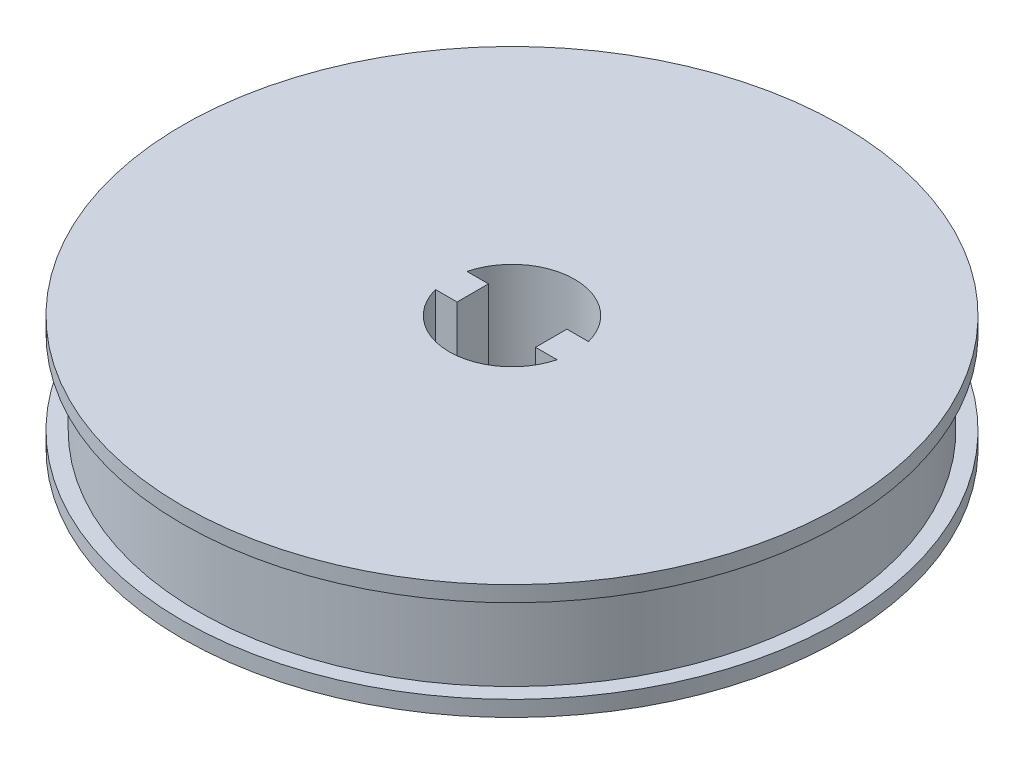
ISO-10303-21;
HEADER;
FILE_DESCRIPTION(('STEP AP214'),'2;1');
FILE_NAME('part.step','',(''),(''),'','','');
FILE_SCHEMA(('AUTOMOTIVE_DESIGN { 1 0 10303 214 1 1 1 1 }'));
ENDSEC;
DATA;
#1=APPLICATION_CONTEXT('core data for automotive mechanical design processes');
#2=APPLICATION_PROTOCOL_DEFINITION('international standard','automotive_design',2000,#1);
#3=PRODUCT_CONTEXT('',#1,'mechanical');
#4=PRODUCT('Part','Part','',(#3));
#5=PRODUCT_RELATED_PRODUCT_CATEGORY('part','',(#4));
#6=PRODUCT_DEFINITION_FORMATION('','',#4);
#7=PRODUCT_DEFINITION_CONTEXT('part definition',#1,'design');
#8=PRODUCT_DEFINITION('design','',#6,#7);
#9=PRODUCT_DEFINITION_SHAPE('','',#8);
#10=(LENGTH_UNIT() NAMED_UNIT(*) SI_UNIT(.MILLI.,.METRE.));
#11=(NAMED_UNIT(*) PLANE_ANGLE_UNIT() SI_UNIT($,.RADIAN.));
#12=(NAMED_UNIT(*) SI_UNIT($,.STERADIAN.) SOLID_ANGLE_UNIT());
#13=UNCERTAINTY_MEASURE_WITH_UNIT(LENGTH_MEASURE(1.E-05),#10,'distance_accuracy_value','');
#14=(GEOMETRIC_REPRESENTATION_CONTEXT(3) GLOBAL_UNCERTAINTY_ASSIGNED_CONTEXT((#13)) GLOBAL_UNIT_ASSIGNED_CONTEXT((#10,
#11,#12)) REPRESENTATION_CONTEXT('',''));
#15=CARTESIAN_POINT('',(0.,0.,0.));
#16=DIRECTION('',(0.,0.,1.));
#17=DIRECTION('',(1.,0.,0.));
#18=AXIS2_PLACEMENT_3D('',#15,#16,#17);
#19=CARTESIAN_POINT('',(0.,0.,0.));
#20=DIRECTION('',(0.,-1.,0.));
#21=DIRECTION('',(0.,0.,-1.));
#22=AXIS2_PLACEMENT_3D('',#19,#20,#21);
#23=CYLINDRICAL_SURFACE('',#22,6.);
#24=DIRECTION('',(0.,-1.,0.));
#25=VECTOR('',#24,1.);
#26=CARTESIAN_POINT('',(5.80947501931113,0.,1.5));
#27=LINE('',#26,#25);
#28=CARTESIAN_POINT('',(5.80947501931113,-5.63471383479231,1.5));
#29=VERTEX_POINT('',#28);
#30=CARTESIAN_POINT('',(5.80947501931113,5.3652861652077,1.5));
#31=VERTEX_POINT('',#30);
#32=EDGE_CURVE('E11',#29,#31,#27,.F.);
#33=ORIENTED_EDGE('',*,*,#32,.F.);
#34=CARTESIAN_POINT('',(0.,-5.6347138347923,0.));
#35=DIRECTION('',(0.,-1.,0.));
#36=DIRECTION('',(0.,0.,-1.));
#37=AXIS2_PLACEMENT_3D('',#34,#35,#36);
#38=CIRCLE('',#37,6.);
#39=CARTESIAN_POINT('',(-5.80947501931113,-5.63471383479231,1.5));
#40=VERTEX_POINT('',#39);
#41=EDGE_CURVE('E152',#29,#40,#38,.T.);
#42=ORIENTED_EDGE('',*,*,#41,.T.);
#43=DIRECTION('',(0.,-1.,0.));
#44=VECTOR('',#43,1.);
#45=CARTESIAN_POINT('',(-5.80947501931113,0.,1.5));
#46=LINE('',#45,#44);
#47=CARTESIAN_POINT('',(-5.80947501931113,5.36528616520769,1.5));
#48=VERTEX_POINT('',#47);
#49=EDGE_CURVE('E175',#48,#40,#46,.T.);
#50=ORIENTED_EDGE('',*,*,#49,.F.);
#51=CARTESIAN_POINT('',(0.,5.3652861652077,0.));
#52=DIRECTION('',(0.,-1.,0.));
#53=DIRECTION('',(0.,0.,-1.));
#54=AXIS2_PLACEMENT_3D('',#51,#52,#53);
#55=CIRCLE('',#54,6.);
#56=EDGE_CURVE('E148',#31,#48,#55,.T.);
#57=ORIENTED_EDGE('',*,*,#56,.F.);
#58=EDGE_LOOP('',(#33,#42,#50,#57));
#59=FACE_BOUND('',#58,.T.);
#60=ADVANCED_FACE('F35',(#59),#23,.F.);
#61=CARTESIAN_POINT('',(6.,5.36528616520769,0.));
#62=DIRECTION('',(0.,1.,0.));
#63=DIRECTION('',(0.,0.,1.));
#64=AXIS2_PLACEMENT_3D('',#61,#62,#63);
#65=PLANE('',#64);
#66=CARTESIAN_POINT('',(-5.80947501931112,5.3652861652077,-1.5));
#67=VERTEX_POINT('',#66);
#68=CARTESIAN_POINT('',(5.80947501931113,5.36528616520769,-1.5));
#69=VERTEX_POINT('',#68);
#70=EDGE_CURVE('E150',#67,#69,#55,.T.);
#71=ORIENTED_EDGE('',*,*,#70,.T.);
#72=DIRECTION('',(-1.,0.,0.));
#73=VECTOR('',#72,1.);
#74=CARTESIAN_POINT('',(8.25,5.36528616520769,-1.5));
#75=LINE('',#74,#73);
#76=CARTESIAN_POINT('',(3.75,5.36528616520769,-1.5));
#77=VERTEX_POINT('',#76);
#78=EDGE_CURVE('E128',#69,#77,#75,.T.);
#79=ORIENTED_EDGE('',*,*,#78,.T.);
#80=DIRECTION('',(0.,0.,1.));
#81=VECTOR('',#80,1.);
#82=CARTESIAN_POINT('',(3.75,5.36528616520769,1.5));
#83=LINE('',#82,#81);
#84=CARTESIAN_POINT('',(3.75,5.36528616520769,1.5));
#85=VERTEX_POINT('',#84);
#86=EDGE_CURVE('E117',#77,#85,#83,.T.);
#87=ORIENTED_EDGE('',*,*,#86,.T.);
#88=DIRECTION('',(1.,0.,0.));
#89=VECTOR('',#88,1.);
#90=CARTESIAN_POINT('',(8.25,5.36528616520769,1.5));
#91=LINE('',#90,#89);
#92=EDGE_CURVE('E50',#85,#31,#91,.T.);
#93=ORIENTED_EDGE('',*,*,#92,.T.);
#94=ORIENTED_EDGE('',*,*,#56,.T.);
#95=DIRECTION('',(1.,0.,0.));
#96=VECTOR('',#95,1.);
#97=CARTESIAN_POINT('',(-8.25,5.36528616520769,1.5));
#98=LINE('',#97,#96);
#99=CARTESIAN_POINT('',(-3.75,5.36528616520769,1.5));
#100=VERTEX_POINT('',#99);
#101=EDGE_CURVE('E137',#48,#100,#98,.T.);
#102=ORIENTED_EDGE('',*,*,#101,.T.);
#103=DIRECTION('',(0.,0.,-1.));
#104=VECTOR('',#103,1.);
#105=CARTESIAN_POINT('',(-3.75,5.36528616520769,1.5));
#106=LINE('',#105,#104);
#107=CARTESIAN_POINT('',(-3.75,5.36528616520769,-1.5));
#108=VERTEX_POINT('',#107);
#109=EDGE_CURVE('E131',#100,#108,#106,.T.);
#110=ORIENTED_EDGE('',*,*,#109,.T.);
#111=DIRECTION('',(-1.,0.,0.));
#112=VECTOR('',#111,1.);
#113=CARTESIAN_POINT('',(-8.25,5.36528616520769,-1.5));
#114=LINE('',#113,#112);
#115=EDGE_CURVE('E56',#108,#67,#114,.T.);
#116=ORIENTED_EDGE('',*,*,#115,.T.);
#117=EDGE_LOOP('',(#71,#79,#87,#93,#94,#102,#110,#116));
#118=FACE_BOUND('',#117,.T.);
#119=CARTESIAN_POINT('',(0.,5.36528616520768,0.));
#120=DIRECTION('',(0.,-1.,0.));
#121=DIRECTION('',(0.,0.,-1.));
#122=AXIS2_PLACEMENT_3D('',#119,#120,#121);
#123=CIRCLE('',#122,31.5);
#124=CARTESIAN_POINT('',(0.,5.36528616520768,-31.5));
#125=VERTEX_POINT('',#124);
#126=EDGE_CURVE('E170',#125,#125,#123,.T.);
#127=ORIENTED_EDGE('',*,*,#126,.F.);
#128=EDGE_LOOP('',(#127));
#129=FACE_BOUND('',#128,.T.);
#130=ADVANCED_FACE('F37',(#118,#129),#65,.T.);
#131=CARTESIAN_POINT('',(0.,0.,0.));
#132=DIRECTION('',(0.,-1.,0.));
#133=DIRECTION('',(0.,0.,-1.));
#134=AXIS2_PLACEMENT_3D('',#131,#132,#133);
#135=CYLINDRICAL_SURFACE('',#134,31.5);
#136=ORIENTED_EDGE('',*,*,#126,.T.);
#137=EDGE_LOOP('',(#136));
#138=FACE_BOUND('',#137,.T.);
#139=CARTESIAN_POINT('',(0.,3.86528616520768,0.));
#140=DIRECTION('',(0.,-1.,0.));
#141=DIRECTION('',(0.,0.,-1.));
#142=AXIS2_PLACEMENT_3D('',#139,#140,#141);
#143=CIRCLE('',#142,31.5);
#144=CARTESIAN_POINT('',(0.,3.86528616520768,-31.5));
#145=VERTEX_POINT('',#144);
#146=EDGE_CURVE('E167',#145,#145,#143,.T.);
#147=ORIENTED_EDGE('',*,*,#146,.F.);
#148=EDGE_LOOP('',(#147));
#149=FACE_BOUND('',#148,.T.);
#150=ADVANCED_FACE('F214',(#138,#149),#135,.T.);
#151=CARTESIAN_POINT('',(31.5,3.86528616520769,0.));
#152=DIRECTION('',(0.,-1.,0.));
#153=DIRECTION('',(0.,0.,-1.));
#154=AXIS2_PLACEMENT_3D('',#151,#152,#153);
#155=PLANE('',#154);
#156=ORIENTED_EDGE('',*,*,#146,.T.);
#157=EDGE_LOOP('',(#156));
#158=FACE_BOUND('',#157,.T.);
#159=CARTESIAN_POINT('',(0.,3.8652861652077,0.));
#160=DIRECTION('',(0.,-1.,0.));
#161=DIRECTION('',(0.,0.,-1.));
#162=AXIS2_PLACEMENT_3D('',#159,#160,#161);
#163=CIRCLE('',#162,30.);
#164=CARTESIAN_POINT('',(0.,3.8652861652077,-30.));
#165=VERTEX_POINT('',#164);
#166=EDGE_CURVE('E164',#165,#165,#163,.T.);
#167=ORIENTED_EDGE('',*,*,#166,.F.);
#168=EDGE_LOOP('',(#167));
#169=FACE_BOUND('',#168,.T.);
#170=ADVANCED_FACE('F235',(#158,#169),#155,.T.);
#171=CARTESIAN_POINT('',(0.,0.,0.));
#172=DIRECTION('',(0.,-1.,0.));
#173=DIRECTION('',(0.,0.,-1.));
#174=AXIS2_PLACEMENT_3D('',#171,#172,#173);
#175=CYLINDRICAL_SURFACE('',#174,30.);
#176=ORIENTED_EDGE('',*,*,#166,.T.);
#177=EDGE_LOOP('',(#176));
#178=FACE_BOUND('',#177,.T.);
#179=CARTESIAN_POINT('',(0.,-4.13471383479228,0.));
#180=DIRECTION('',(0.,-1.,0.));
#181=DIRECTION('',(0.,0.,-1.));
#182=AXIS2_PLACEMENT_3D('',#179,#180,#181);
#183=CIRCLE('',#182,30.);
#184=CARTESIAN_POINT('',(0.,-4.13471383479228,-30.));
#185=VERTEX_POINT('',#184);
#186=EDGE_CURVE('E161',#185,#185,#183,.T.);
#187=ORIENTED_EDGE('',*,*,#186,.F.);
#188=EDGE_LOOP('',(#187));
#189=FACE_BOUND('',#188,.T.);
#190=ADVANCED_FACE('F231',(#178,#189),#175,.T.);
#191=CARTESIAN_POINT('',(30.,-4.13471383479228,0.));
#192=DIRECTION('',(0.,1.,0.));
#193=DIRECTION('',(0.,0.,1.));
#194=AXIS2_PLACEMENT_3D('',#191,#192,#193);
#195=PLANE('',#194);
#196=ORIENTED_EDGE('',*,*,#186,.T.);
#197=EDGE_LOOP('',(#196));
#198=FACE_BOUND('',#197,.T.);
#199=CARTESIAN_POINT('',(0.,-4.13471383479228,0.));
#200=DIRECTION('',(0.,-1.,0.));
#201=DIRECTION('',(0.,0.,-1.));
#202=AXIS2_PLACEMENT_3D('',#199,#200,#201);
#203=CIRCLE('',#202,31.5);
#204=CARTESIAN_POINT('',(0.,-4.13471383479228,-31.5));
#205=VERTEX_POINT('',#204);
#206=EDGE_CURVE('E158',#205,#205,#203,.T.);
#207=ORIENTED_EDGE('',*,*,#206,.F.);
#208=EDGE_LOOP('',(#207));
#209=FACE_BOUND('',#208,.T.);
#210=ADVANCED_FACE('F225',(#198,#209),#195,.T.);
#211=CARTESIAN_POINT('',(0.,0.,0.));
#212=DIRECTION('',(0.,-1.,0.));
#213=DIRECTION('',(0.,0.,-1.));
#214=AXIS2_PLACEMENT_3D('',#211,#212,#213);
#215=CYLINDRICAL_SURFACE('',#214,31.5);
#216=ORIENTED_EDGE('',*,*,#206,.T.);
#217=EDGE_LOOP('',(#216));
#218=FACE_BOUND('',#217,.T.);
#219=CARTESIAN_POINT('',(0.,-5.63471383479228,0.));
#220=DIRECTION('',(0.,-1.,0.));
#221=DIRECTION('',(0.,0.,-1.));
#222=AXIS2_PLACEMENT_3D('',#219,#220,#221);
#223=CIRCLE('',#222,31.5);
#224=CARTESIAN_POINT('',(0.,-5.63471383479228,-31.5));
#225=VERTEX_POINT('',#224);
#226=EDGE_CURVE('E155',#225,#225,#223,.T.);
#227=ORIENTED_EDGE('',*,*,#226,.F.);
#228=EDGE_LOOP('',(#227));
#229=FACE_BOUND('',#228,.T.);
#230=ADVANCED_FACE('F221',(#218,#229),#215,.T.);
#231=CARTESIAN_POINT('',(31.5,-5.63471383479229,0.));
#232=DIRECTION('',(0.,-1.,0.));
#233=DIRECTION('',(0.,0.,-1.));
#234=AXIS2_PLACEMENT_3D('',#231,#232,#233);
#235=PLANE('',#234);
#236=ORIENTED_EDGE('',*,*,#41,.F.);
#237=DIRECTION('',(1.,0.,0.));
#238=VECTOR('',#237,1.);
#239=CARTESIAN_POINT('',(8.25,-5.63471383479231,1.5));
#240=LINE('',#239,#238);
#241=CARTESIAN_POINT('',(3.75,-5.63471383479231,1.5));
#242=VERTEX_POINT('',#241);
#243=EDGE_CURVE('E112',#242,#29,#240,.T.);
#244=ORIENTED_EDGE('',*,*,#243,.F.);
#245=DIRECTION('',(0.,0.,1.));
#246=VECTOR('',#245,1.);
#247=CARTESIAN_POINT('',(3.75,-5.63471383479231,1.5));
#248=LINE('',#247,#246);
#249=CARTESIAN_POINT('',(3.75,-5.63471383479231,-1.5));
#250=VERTEX_POINT('',#249);
#251=EDGE_CURVE('E111',#250,#242,#248,.T.);
#252=ORIENTED_EDGE('',*,*,#251,.F.);
#253=DIRECTION('',(-1.,0.,0.));
#254=VECTOR('',#253,1.);
#255=CARTESIAN_POINT('',(8.25,-5.63471383479231,-1.5));
#256=LINE('',#255,#254);
#257=CARTESIAN_POINT('',(5.80947501931113,-5.63471383479231,-1.5));
#258=VERTEX_POINT('',#257);
#259=EDGE_CURVE('E101',#258,#250,#256,.T.);
#260=ORIENTED_EDGE('',*,*,#259,.F.);
#261=CARTESIAN_POINT('',(-5.80947501931113,-5.63471383479231,-1.5));
#262=VERTEX_POINT('',#261);
#263=EDGE_CURVE('E153',#262,#258,#38,.T.);
#264=ORIENTED_EDGE('',*,*,#263,.F.);
#265=DIRECTION('',(-1.,0.,0.));
#266=VECTOR('',#265,1.);
#267=CARTESIAN_POINT('',(-8.25,-5.63471383479231,-1.5));
#268=LINE('',#267,#266);
#269=CARTESIAN_POINT('',(-3.75,-5.63471383479231,-1.5));
#270=VERTEX_POINT('',#269);
#271=EDGE_CURVE('E136',#270,#262,#268,.T.);
#272=ORIENTED_EDGE('',*,*,#271,.F.);
#273=DIRECTION('',(0.,0.,-1.));
#274=VECTOR('',#273,1.);
#275=CARTESIAN_POINT('',(-3.75,-5.63471383479231,1.5));
#276=LINE('',#275,#274);
#277=CARTESIAN_POINT('',(-3.75,-5.63471383479231,1.5));
#278=VERTEX_POINT('',#277);
#279=EDGE_CURVE('E133',#278,#270,#276,.T.);
#280=ORIENTED_EDGE('',*,*,#279,.F.);
#281=DIRECTION('',(1.,0.,0.));
#282=VECTOR('',#281,1.);
#283=CARTESIAN_POINT('',(-8.25,-5.63471383479231,1.5));
#284=LINE('',#283,#282);
#285=EDGE_CURVE('E139',#40,#278,#284,.T.);
#286=ORIENTED_EDGE('',*,*,#285,.F.);
#287=EDGE_LOOP('',(#236,#244,#252,#260,#264,#272,#280,#286));
#288=FACE_BOUND('',#287,.T.);
#289=ORIENTED_EDGE('',*,*,#226,.T.);
#290=EDGE_LOOP('',(#289));
#291=FACE_BOUND('',#290,.T.);
#292=ADVANCED_FACE('F122',(#288,#291),#235,.T.);
#293=DIRECTION('',(0.,-1.,0.));
#294=VECTOR('',#293,1.);
#295=CARTESIAN_POINT('',(5.80947501931113,0.,-1.5));
#296=LINE('',#295,#294);
#297=EDGE_CURVE('E43',#69,#258,#296,.T.);
#298=ORIENTED_EDGE('',*,*,#297,.F.);
#299=ORIENTED_EDGE('',*,*,#70,.F.);
#300=DIRECTION('',(0.,-1.,0.));
#301=VECTOR('',#300,1.);
#302=CARTESIAN_POINT('',(-5.80947501931113,0.,-1.5));
#303=LINE('',#302,#301);
#304=EDGE_CURVE('E173',#262,#67,#303,.F.);
#305=ORIENTED_EDGE('',*,*,#304,.F.);
#306=ORIENTED_EDGE('',*,*,#263,.T.);
#307=EDGE_LOOP('',(#298,#299,#305,#306));
#308=FACE_BOUND('',#307,.T.);
#309=ADVANCED_FACE('F196',(#308),#23,.F.);
#310=CARTESIAN_POINT('',(-3.75,-5.63471383479231,1.5));
#311=DIRECTION('',(1.,0.,0.));
#312=DIRECTION('',(0.,0.,-1.));
#313=AXIS2_PLACEMENT_3D('',#310,#311,#312);
#314=PLANE('',#313);
#315=ORIENTED_EDGE('',*,*,#109,.F.);
#316=DIRECTION('',(0.,1.,0.));
#317=VECTOR('',#316,1.);
#318=CARTESIAN_POINT('',(-3.75,-5.63471383479231,1.5));
#319=LINE('',#318,#317);
#320=EDGE_CURVE('E145',#278,#100,#319,.T.);
#321=ORIENTED_EDGE('',*,*,#320,.F.);
#322=ORIENTED_EDGE('',*,*,#279,.T.);
#323=DIRECTION('',(0.,1.,0.));
#324=VECTOR('',#323,1.);
#325=CARTESIAN_POINT('',(-3.75,-5.63471383479231,-1.5));
#326=LINE('',#325,#324);
#327=EDGE_CURVE('E141',#270,#108,#326,.T.);
#328=ORIENTED_EDGE('',*,*,#327,.T.);
#329=EDGE_LOOP('',(#315,#321,#322,#328));
#330=FACE_BOUND('',#329,.T.);
#331=ADVANCED_FACE('F189',(#330),#314,.T.);
#332=CARTESIAN_POINT('',(-8.25,-5.63471383479231,1.5));
#333=DIRECTION('',(0.,0.,1.));
#334=DIRECTION('',(1.,0.,0.));
#335=AXIS2_PLACEMENT_3D('',#332,#333,#334);
#336=PLANE('',#335);
#337=ORIENTED_EDGE('',*,*,#101,.F.);
#338=ORIENTED_EDGE('',*,*,#49,.T.);
#339=ORIENTED_EDGE('',*,*,#285,.T.);
#340=ORIENTED_EDGE('',*,*,#320,.T.);
#341=EDGE_LOOP('',(#337,#338,#339,#340));
#342=FACE_BOUND('',#341,.T.);
#343=ADVANCED_FACE('F181',(#342),#336,.T.);
#344=CARTESIAN_POINT('',(-8.25,-5.63471383479231,-1.5));
#345=DIRECTION('',(0.,0.,-1.));
#346=DIRECTION('',(-1.,0.,0.));
#347=AXIS2_PLACEMENT_3D('',#344,#345,#346);
#348=PLANE('',#347);
#349=ORIENTED_EDGE('',*,*,#271,.T.);
#350=ORIENTED_EDGE('',*,*,#304,.T.);
#351=ORIENTED_EDGE('',*,*,#115,.F.);
#352=ORIENTED_EDGE('',*,*,#327,.F.);
#353=EDGE_LOOP('',(#349,#350,#351,#352));
#354=FACE_BOUND('',#353,.T.);
#355=ADVANCED_FACE('F199',(#354),#348,.T.);
#356=CARTESIAN_POINT('',(8.25,-5.63471383479231,1.5));
#357=DIRECTION('',(0.,0.,1.));
#358=DIRECTION('',(1.,0.,0.));
#359=AXIS2_PLACEMENT_3D('',#356,#357,#358);
#360=PLANE('',#359);
#361=ORIENTED_EDGE('',*,*,#243,.T.);
#362=ORIENTED_EDGE('',*,*,#32,.T.);
#363=ORIENTED_EDGE('',*,*,#92,.F.);
#364=DIRECTION('',(0.,1.,0.));
#365=VECTOR('',#364,1.);
#366=CARTESIAN_POINT('',(3.75,-5.63471383479231,1.5));
#367=LINE('',#366,#365);
#368=EDGE_CURVE('E118',#242,#85,#367,.T.);
#369=ORIENTED_EDGE('',*,*,#368,.F.);
#370=EDGE_LOOP('',(#361,#362,#363,#369));
#371=FACE_BOUND('',#370,.T.);
#372=ADVANCED_FACE('F193',(#371),#360,.T.);
#373=CARTESIAN_POINT('',(3.75,-5.63471383479231,1.5));
#374=DIRECTION('',(-1.,0.,0.));
#375=DIRECTION('',(0.,0.,1.));
#376=AXIS2_PLACEMENT_3D('',#373,#374,#375);
#377=PLANE('',#376);
#378=ORIENTED_EDGE('',*,*,#86,.F.);
#379=DIRECTION('',(0.,1.,0.));
#380=VECTOR('',#379,1.);
#381=CARTESIAN_POINT('',(3.75,-5.63471383479231,-1.5));
#382=LINE('',#381,#380);
#383=EDGE_CURVE('E104',#250,#77,#382,.T.);
#384=ORIENTED_EDGE('',*,*,#383,.F.);
#385=ORIENTED_EDGE('',*,*,#251,.T.);
#386=ORIENTED_EDGE('',*,*,#368,.T.);
#387=EDGE_LOOP('',(#378,#384,#385,#386));
#388=FACE_BOUND('',#387,.T.);
#389=ADVANCED_FACE('F116',(#388),#377,.T.);
#390=CARTESIAN_POINT('',(8.25,-5.63471383479231,-1.5));
#391=DIRECTION('',(0.,0.,-1.));
#392=DIRECTION('',(-1.,0.,0.));
#393=AXIS2_PLACEMENT_3D('',#390,#391,#392);
#394=PLANE('',#393);
#395=ORIENTED_EDGE('',*,*,#78,.F.);
#396=ORIENTED_EDGE('',*,*,#297,.T.);
#397=ORIENTED_EDGE('',*,*,#259,.T.);
#398=ORIENTED_EDGE('',*,*,#383,.T.);
#399=EDGE_LOOP('',(#395,#396,#397,#398));
#400=FACE_BOUND('',#399,.T.);
#401=ADVANCED_FACE('F103',(#400),#394,.T.);
#402=CLOSED_SHELL('',(#60,#130,#150,#170,#190,#210,#230,#292,#309,#331,#343,#355,#372,#389,#401));
#403=MANIFOLD_SOLID_BREP('B2',#402);
#404=ADVANCED_BREP_SHAPE_REPRESENTATION('',(#18,#403),#14);
#405=SHAPE_DEFINITION_REPRESENTATION(#9,#404);
ENDSEC;
END-ISO-10303-21;
